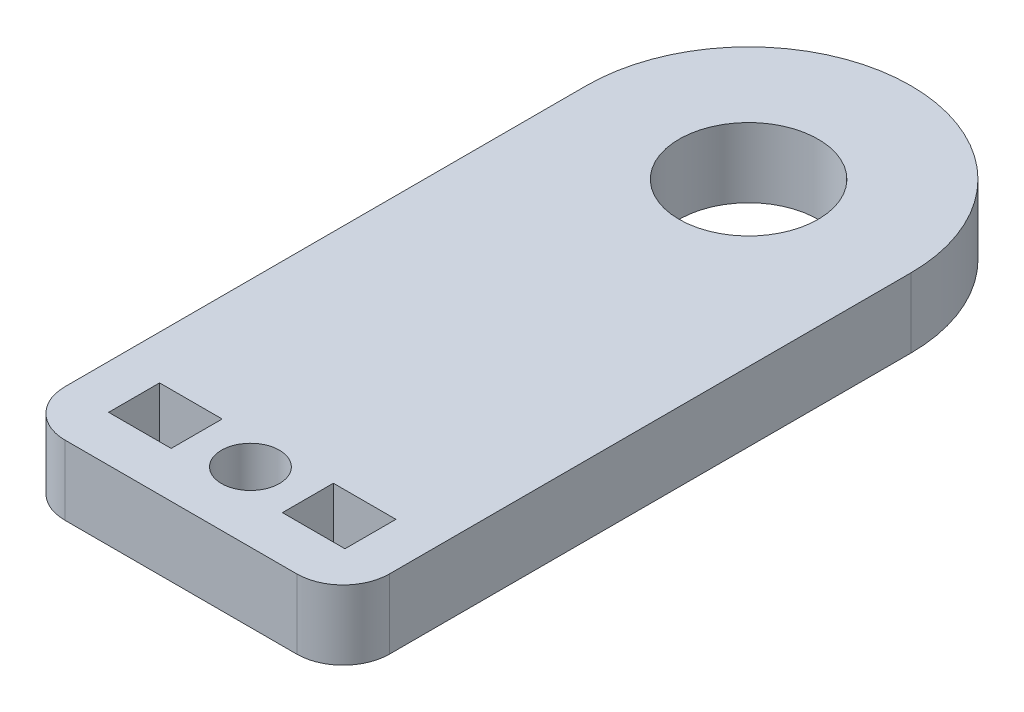
ISO-10303-21;
HEADER;
FILE_DESCRIPTION(('STEP AP214'),'2;1');
FILE_NAME('part.step','',(''),(''),'','','');
FILE_SCHEMA(('AUTOMOTIVE_DESIGN { 1 0 10303 214 1 1 1 1 }'));
ENDSEC;
DATA;
#1=APPLICATION_CONTEXT('core data for automotive mechanical design processes');
#2=APPLICATION_PROTOCOL_DEFINITION('international standard','automotive_design',2000,#1);
#3=PRODUCT_CONTEXT('',#1,'mechanical');
#4=PRODUCT('Part','Part','',(#3));
#5=PRODUCT_RELATED_PRODUCT_CATEGORY('part','',(#4));
#6=PRODUCT_DEFINITION_FORMATION('','',#4);
#7=PRODUCT_DEFINITION_CONTEXT('part definition',#1,'design');
#8=PRODUCT_DEFINITION('design','',#6,#7);
#9=PRODUCT_DEFINITION_SHAPE('','',#8);
#10=(LENGTH_UNIT() NAMED_UNIT(*) SI_UNIT(.MILLI.,.METRE.));
#11=(NAMED_UNIT(*) PLANE_ANGLE_UNIT() SI_UNIT($,.RADIAN.));
#12=(NAMED_UNIT(*) SI_UNIT($,.STERADIAN.) SOLID_ANGLE_UNIT());
#13=UNCERTAINTY_MEASURE_WITH_UNIT(LENGTH_MEASURE(1.E-05),#10,'distance_accuracy_value','');
#14=(GEOMETRIC_REPRESENTATION_CONTEXT(3) GLOBAL_UNCERTAINTY_ASSIGNED_CONTEXT((#13)) GLOBAL_UNIT_ASSIGNED_CONTEXT((#10,
#11,#12)) REPRESENTATION_CONTEXT('',''));
#15=CARTESIAN_POINT('',(0.,0.,0.));
#16=DIRECTION('',(0.,0.,1.));
#17=DIRECTION('',(1.,0.,0.));
#18=AXIS2_PLACEMENT_3D('',#15,#16,#17);
#19=CARTESIAN_POINT('',(0.,3.,-12.25));
#20=DIRECTION('',(0.,-1.,0.));
#21=DIRECTION('',(0.,0.,-1.));
#22=AXIS2_PLACEMENT_3D('',#19,#20,#21);
#23=CYLINDRICAL_SURFACE('',#22,7.);
#24=DIRECTION('',(0.,-1.,0.));
#25=VECTOR('',#24,1.);
#26=CARTESIAN_POINT('',(-7.,3.,-12.25));
#27=LINE('',#26,#25);
#28=CARTESIAN_POINT('',(-7.,3.,-12.25));
#29=VERTEX_POINT('',#28);
#30=CARTESIAN_POINT('',(-7.,0.,-12.25));
#31=VERTEX_POINT('',#30);
#32=EDGE_CURVE('E225',#29,#31,#27,.T.);
#33=ORIENTED_EDGE('',*,*,#32,.F.);
#34=CARTESIAN_POINT('',(0.,3.,-12.25));
#35=DIRECTION('',(0.,1.,0.));
#36=DIRECTION('',(0.,0.,1.));
#37=AXIS2_PLACEMENT_3D('',#34,#35,#36);
#38=CIRCLE('',#37,7.);
#39=CARTESIAN_POINT('',(7.,3.,-12.25));
#40=VERTEX_POINT('',#39);
#41=EDGE_CURVE('E233',#40,#29,#38,.T.);
#42=ORIENTED_EDGE('',*,*,#41,.F.);
#43=DIRECTION('',(0.,-1.,0.));
#44=VECTOR('',#43,1.);
#45=CARTESIAN_POINT('',(7.,3.,-12.25));
#46=LINE('',#45,#44);
#47=CARTESIAN_POINT('',(7.,0.,-12.25));
#48=VERTEX_POINT('',#47);
#49=EDGE_CURVE('E181',#40,#48,#46,.T.);
#50=ORIENTED_EDGE('',*,*,#49,.T.);
#51=CARTESIAN_POINT('',(0.,0.,-12.25));
#52=DIRECTION('',(0.,1.,0.));
#53=DIRECTION('',(0.,0.,1.));
#54=AXIS2_PLACEMENT_3D('',#51,#52,#53);
#55=CIRCLE('',#54,7.);
#56=EDGE_CURVE('E221',#48,#31,#55,.T.);
#57=ORIENTED_EDGE('',*,*,#56,.T.);
#58=EDGE_LOOP('',(#33,#42,#50,#57));
#59=FACE_BOUND('',#58,.T.);
#60=ADVANCED_FACE('F37',(#59),#23,.T.);
#61=CARTESIAN_POINT('',(0.,3.,-12.25));
#62=DIRECTION('',(0.,-1.,0.));
#63=DIRECTION('',(0.,0.,-1.));
#64=AXIS2_PLACEMENT_3D('',#61,#62,#63);
#65=CYLINDRICAL_SURFACE('',#64,3.);
#66=CARTESIAN_POINT('',(0.,3.,-12.25));
#67=DIRECTION('',(0.,1.,0.));
#68=DIRECTION('',(0.,0.,1.));
#69=AXIS2_PLACEMENT_3D('',#66,#67,#68);
#70=CIRCLE('',#69,3.);
#71=CARTESIAN_POINT('',(0.,3.,-9.25));
#72=VERTEX_POINT('',#71);
#73=EDGE_CURVE('E236',#72,#72,#70,.T.);
#74=ORIENTED_EDGE('',*,*,#73,.T.);
#75=EDGE_LOOP('',(#74));
#76=FACE_BOUND('',#75,.T.);
#77=CARTESIAN_POINT('',(0.,0.,-12.25));
#78=DIRECTION('',(0.,1.,0.));
#79=DIRECTION('',(0.,0.,1.));
#80=AXIS2_PLACEMENT_3D('',#77,#78,#79);
#81=CIRCLE('',#80,3.);
#82=CARTESIAN_POINT('',(0.,0.,-9.25));
#83=VERTEX_POINT('',#82);
#84=EDGE_CURVE('E237',#83,#83,#81,.T.);
#85=ORIENTED_EDGE('',*,*,#84,.F.);
#86=EDGE_LOOP('',(#85));
#87=FACE_BOUND('',#86,.T.);
#88=ADVANCED_FACE('F292',(#76,#87),#65,.F.);
#89=CARTESIAN_POINT('',(0.,3.,0.));
#90=DIRECTION('',(0.,1.,0.));
#91=DIRECTION('',(0.,0.,1.));
#92=AXIS2_PLACEMENT_3D('',#89,#90,#91);
#93=PLANE('',#92);
#94=DIRECTION('',(1.,0.,0.));
#95=VECTOR('',#94,1.);
#96=CARTESIAN_POINT('',(0.,3.,12.25));
#97=LINE('',#96,#95);
#98=CARTESIAN_POINT('',(-4.99999999999999,3.,12.25));
#99=VERTEX_POINT('',#98);
#100=CARTESIAN_POINT('',(5.,3.,12.25));
#101=VERTEX_POINT('',#100);
#102=EDGE_CURVE('E261',#99,#101,#97,.T.);
#103=ORIENTED_EDGE('',*,*,#102,.T.);
#104=CARTESIAN_POINT('',(5.,3.,10.25));
#105=DIRECTION('',(0.,1.,0.));
#106=DIRECTION('',(0.,0.,1.));
#107=AXIS2_PLACEMENT_3D('',#104,#105,#106);
#108=CIRCLE('',#107,2.);
#109=CARTESIAN_POINT('',(7.,3.,10.25));
#110=VERTEX_POINT('',#109);
#111=EDGE_CURVE('E45',#101,#110,#108,.T.);
#112=ORIENTED_EDGE('',*,*,#111,.T.);
#113=DIRECTION('',(0.,0.,-1.));
#114=VECTOR('',#113,1.);
#115=CARTESIAN_POINT('',(7.,3.,0.));
#116=LINE('',#115,#114);
#117=EDGE_CURVE('E160',#110,#40,#116,.T.);
#118=ORIENTED_EDGE('',*,*,#117,.T.);
#119=ORIENTED_EDGE('',*,*,#41,.T.);
#120=DIRECTION('',(0.,0.,-1.));
#121=VECTOR('',#120,1.);
#122=CARTESIAN_POINT('',(-7.,3.,0.));
#123=LINE('',#122,#121);
#124=CARTESIAN_POINT('',(-6.99999999999999,3.,10.25));
#125=VERTEX_POINT('',#124);
#126=EDGE_CURVE('E280',#125,#29,#123,.T.);
#127=ORIENTED_EDGE('',*,*,#126,.F.);
#128=CARTESIAN_POINT('',(-4.99999999999999,3.,10.25));
#129=DIRECTION('',(0.,1.,0.));
#130=DIRECTION('',(0.,0.,1.));
#131=AXIS2_PLACEMENT_3D('',#128,#129,#130);
#132=CIRCLE('',#131,2.);
#133=EDGE_CURVE('E255',#125,#99,#132,.T.);
#134=ORIENTED_EDGE('',*,*,#133,.T.);
#135=EDGE_LOOP('',(#103,#112,#118,#119,#127,#134));
#136=FACE_BOUND('',#135,.T.);
#137=ORIENTED_EDGE('',*,*,#73,.F.);
#138=EDGE_LOOP('',(#137));
#139=FACE_BOUND('',#138,.T.);
#140=CARTESIAN_POINT('',(0.,3.,9.25));
#141=DIRECTION('',(0.,1.,0.));
#142=DIRECTION('',(0.,0.,1.));
#143=AXIS2_PLACEMENT_3D('',#140,#141,#142);
#144=CIRCLE('',#143,1.25);
#145=CARTESIAN_POINT('',(0.,3.,10.5));
#146=VERTEX_POINT('',#145);
#147=EDGE_CURVE('E212',#146,#146,#144,.T.);
#148=ORIENTED_EDGE('',*,*,#147,.F.);
#149=EDGE_LOOP('',(#148));
#150=FACE_BOUND('',#149,.T.);
#151=DIRECTION('',(0.,0.,1.));
#152=VECTOR('',#151,1.);
#153=CARTESIAN_POINT('',(-5.1,3.,0.));
#154=LINE('',#153,#152);
#155=CARTESIAN_POINT('',(-5.1,3.,8.07071615635404));
#156=VERTEX_POINT('',#155);
#157=CARTESIAN_POINT('',(-5.1,3.,10.270716156354));
#158=VERTEX_POINT('',#157);
#159=EDGE_CURVE('E142',#156,#158,#154,.T.);
#160=ORIENTED_EDGE('',*,*,#159,.F.);
#161=DIRECTION('',(-1.,0.,0.));
#162=VECTOR('',#161,1.);
#163=CARTESIAN_POINT('',(0.,3.,8.07071615635404));
#164=LINE('',#163,#162);
#165=CARTESIAN_POINT('',(-2.4,3.,8.07071615635404));
#166=VERTEX_POINT('',#165);
#167=EDGE_CURVE('E157',#166,#156,#164,.T.);
#168=ORIENTED_EDGE('',*,*,#167,.F.);
#169=DIRECTION('',(0.,0.,1.));
#170=VECTOR('',#169,1.);
#171=CARTESIAN_POINT('',(-2.4,3.,0.));
#172=LINE('',#171,#170);
#173=CARTESIAN_POINT('',(-2.4,3.,10.270716156354));
#174=VERTEX_POINT('',#173);
#175=EDGE_CURVE('E164',#166,#174,#172,.T.);
#176=ORIENTED_EDGE('',*,*,#175,.T.);
#177=DIRECTION('',(-1.,0.,0.));
#178=VECTOR('',#177,1.);
#179=CARTESIAN_POINT('',(0.,3.,10.270716156354));
#180=LINE('',#179,#178);
#181=EDGE_CURVE('E158',#174,#158,#180,.T.);
#182=ORIENTED_EDGE('',*,*,#181,.T.);
#183=EDGE_LOOP('',(#160,#168,#176,#182));
#184=FACE_BOUND('',#183,.T.);
#185=DIRECTION('',(0.,0.,1.));
#186=VECTOR('',#185,1.);
#187=CARTESIAN_POINT('',(2.40000000000001,3.,0.));
#188=LINE('',#187,#186);
#189=CARTESIAN_POINT('',(2.40000000000001,3.,8.07071615635404));
#190=VERTEX_POINT('',#189);
#191=CARTESIAN_POINT('',(2.40000000000001,3.,10.270716156354));
#192=VERTEX_POINT('',#191);
#193=EDGE_CURVE('E170',#190,#192,#188,.T.);
#194=ORIENTED_EDGE('',*,*,#193,.F.);
#195=DIRECTION('',(1.,0.,0.));
#196=VECTOR('',#195,1.);
#197=CARTESIAN_POINT('',(0.,3.,8.07071615635404));
#198=LINE('',#197,#196);
#199=CARTESIAN_POINT('',(5.10000000000001,3.,8.07071615635404));
#200=VERTEX_POINT('',#199);
#201=EDGE_CURVE('E173',#190,#200,#198,.T.);
#202=ORIENTED_EDGE('',*,*,#201,.T.);
#203=DIRECTION('',(0.,0.,1.));
#204=VECTOR('',#203,1.);
#205=CARTESIAN_POINT('',(5.10000000000001,3.,0.));
#206=LINE('',#205,#204);
#207=CARTESIAN_POINT('',(5.10000000000001,3.,10.270716156354));
#208=VERTEX_POINT('',#207);
#209=EDGE_CURVE('E176',#200,#208,#206,.T.);
#210=ORIENTED_EDGE('',*,*,#209,.T.);
#211=DIRECTION('',(1.,0.,0.));
#212=VECTOR('',#211,1.);
#213=CARTESIAN_POINT('',(0.,3.,10.270716156354));
#214=LINE('',#213,#212);
#215=EDGE_CURVE('E178',#192,#208,#214,.T.);
#216=ORIENTED_EDGE('',*,*,#215,.F.);
#217=EDGE_LOOP('',(#194,#202,#210,#216));
#218=FACE_BOUND('',#217,.T.);
#219=ADVANCED_FACE('F154',(#136,#139,#150,#184,#218),#93,.T.);
#220=CARTESIAN_POINT('',(0.,0.,0.));
#221=DIRECTION('',(0.,1.,0.));
#222=DIRECTION('',(0.,0.,1.));
#223=AXIS2_PLACEMENT_3D('',#220,#221,#222);
#224=PLANE('',#223);
#225=DIRECTION('',(0.,0.,-1.));
#226=VECTOR('',#225,1.);
#227=CARTESIAN_POINT('',(7.,0.,0.));
#228=LINE('',#227,#226);
#229=CARTESIAN_POINT('',(7.,0.,10.25));
#230=VERTEX_POINT('',#229);
#231=EDGE_CURVE('E189',#230,#48,#228,.T.);
#232=ORIENTED_EDGE('',*,*,#231,.F.);
#233=CARTESIAN_POINT('',(5.,0.,10.25));
#234=DIRECTION('',(0.,1.,0.));
#235=DIRECTION('',(0.,0.,1.));
#236=AXIS2_PLACEMENT_3D('',#233,#234,#235);
#237=CIRCLE('',#236,2.);
#238=CARTESIAN_POINT('',(5.,0.,12.25));
#239=VERTEX_POINT('',#238);
#240=EDGE_CURVE('E249',#230,#239,#237,.F.);
#241=ORIENTED_EDGE('',*,*,#240,.T.);
#242=DIRECTION('',(1.,0.,0.));
#243=VECTOR('',#242,1.);
#244=CARTESIAN_POINT('',(0.,0.,12.25));
#245=LINE('',#244,#243);
#246=CARTESIAN_POINT('',(-4.99999999999999,0.,12.25));
#247=VERTEX_POINT('',#246);
#248=EDGE_CURVE('E187',#247,#239,#245,.T.);
#249=ORIENTED_EDGE('',*,*,#248,.F.);
#250=CARTESIAN_POINT('',(-4.99999999999999,0.,10.25));
#251=DIRECTION('',(0.,1.,0.));
#252=DIRECTION('',(0.,0.,1.));
#253=AXIS2_PLACEMENT_3D('',#250,#251,#252);
#254=CIRCLE('',#253,2.);
#255=CARTESIAN_POINT('',(-6.99999999999999,0.,10.25));
#256=VERTEX_POINT('',#255);
#257=EDGE_CURVE('E247',#247,#256,#254,.F.);
#258=ORIENTED_EDGE('',*,*,#257,.T.);
#259=DIRECTION('',(0.,0.,-1.));
#260=VECTOR('',#259,1.);
#261=CARTESIAN_POINT('',(-7.,0.,0.));
#262=LINE('',#261,#260);
#263=EDGE_CURVE('E185',#256,#31,#262,.T.);
#264=ORIENTED_EDGE('',*,*,#263,.T.);
#265=ORIENTED_EDGE('',*,*,#56,.F.);
#266=EDGE_LOOP('',(#232,#241,#249,#258,#264,#265));
#267=FACE_BOUND('',#266,.T.);
#268=ORIENTED_EDGE('',*,*,#84,.T.);
#269=EDGE_LOOP('',(#268));
#270=FACE_BOUND('',#269,.T.);
#271=CARTESIAN_POINT('',(0.,0.,9.25));
#272=DIRECTION('',(0.,1.,0.));
#273=DIRECTION('',(0.,0.,1.));
#274=AXIS2_PLACEMENT_3D('',#271,#272,#273);
#275=CIRCLE('',#274,1.25);
#276=CARTESIAN_POINT('',(0.,0.,10.5));
#277=VERTEX_POINT('',#276);
#278=EDGE_CURVE('E182',#277,#277,#275,.T.);
#279=ORIENTED_EDGE('',*,*,#278,.T.);
#280=EDGE_LOOP('',(#279));
#281=FACE_BOUND('',#280,.T.);
#282=DIRECTION('',(0.,0.,1.));
#283=VECTOR('',#282,1.);
#284=CARTESIAN_POINT('',(-5.1,0.,0.));
#285=LINE('',#284,#283);
#286=CARTESIAN_POINT('',(-5.1,0.,8.07071615635404));
#287=VERTEX_POINT('',#286);
#288=CARTESIAN_POINT('',(-5.1,0.,10.270716156354));
#289=VERTEX_POINT('',#288);
#290=EDGE_CURVE('E144',#287,#289,#285,.T.);
#291=ORIENTED_EDGE('',*,*,#290,.T.);
#292=DIRECTION('',(-1.,0.,0.));
#293=VECTOR('',#292,1.);
#294=CARTESIAN_POINT('',(0.,0.,10.270716156354));
#295=LINE('',#294,#293);
#296=CARTESIAN_POINT('',(-2.4,0.,10.270716156354));
#297=VERTEX_POINT('',#296);
#298=EDGE_CURVE('E197',#297,#289,#295,.T.);
#299=ORIENTED_EDGE('',*,*,#298,.F.);
#300=DIRECTION('',(0.,0.,1.));
#301=VECTOR('',#300,1.);
#302=CARTESIAN_POINT('',(-2.4,0.,0.));
#303=LINE('',#302,#301);
#304=CARTESIAN_POINT('',(-2.4,0.,8.07071615635404));
#305=VERTEX_POINT('',#304);
#306=EDGE_CURVE('E194',#305,#297,#303,.T.);
#307=ORIENTED_EDGE('',*,*,#306,.F.);
#308=DIRECTION('',(-1.,0.,0.));
#309=VECTOR('',#308,1.);
#310=CARTESIAN_POINT('',(0.,0.,8.07071615635404));
#311=LINE('',#310,#309);
#312=EDGE_CURVE('E192',#305,#287,#311,.T.);
#313=ORIENTED_EDGE('',*,*,#312,.T.);
#314=EDGE_LOOP('',(#291,#299,#307,#313));
#315=FACE_BOUND('',#314,.T.);
#316=DIRECTION('',(0.,0.,1.));
#317=VECTOR('',#316,1.);
#318=CARTESIAN_POINT('',(2.40000000000001,0.,0.));
#319=LINE('',#318,#317);
#320=CARTESIAN_POINT('',(2.40000000000001,0.,8.07071615635404));
#321=VERTEX_POINT('',#320);
#322=CARTESIAN_POINT('',(2.40000000000001,0.,10.270716156354));
#323=VERTEX_POINT('',#322);
#324=EDGE_CURVE('E200',#321,#323,#319,.T.);
#325=ORIENTED_EDGE('',*,*,#324,.T.);
#326=DIRECTION('',(1.,0.,0.));
#327=VECTOR('',#326,1.);
#328=CARTESIAN_POINT('',(0.,0.,10.270716156354));
#329=LINE('',#328,#327);
#330=CARTESIAN_POINT('',(5.10000000000001,0.,10.270716156354));
#331=VERTEX_POINT('',#330);
#332=EDGE_CURVE('E209',#323,#331,#329,.T.);
#333=ORIENTED_EDGE('',*,*,#332,.T.);
#334=DIRECTION('',(0.,0.,1.));
#335=VECTOR('',#334,1.);
#336=CARTESIAN_POINT('',(5.10000000000001,0.,0.));
#337=LINE('',#336,#335);
#338=CARTESIAN_POINT('',(5.10000000000001,0.,8.07071615635404));
#339=VERTEX_POINT('',#338);
#340=EDGE_CURVE('E206',#339,#331,#337,.T.);
#341=ORIENTED_EDGE('',*,*,#340,.F.);
#342=DIRECTION('',(1.,0.,0.));
#343=VECTOR('',#342,1.);
#344=CARTESIAN_POINT('',(0.,0.,8.07071615635404));
#345=LINE('',#344,#343);
#346=EDGE_CURVE('E203',#321,#339,#345,.T.);
#347=ORIENTED_EDGE('',*,*,#346,.F.);
#348=EDGE_LOOP('',(#325,#333,#341,#347));
#349=FACE_BOUND('',#348,.T.);
#350=ADVANCED_FACE('F271',(#267,#270,#281,#315,#349),#224,.F.);
#351=CARTESIAN_POINT('',(2.40000000000001,3.,0.));
#352=DIRECTION('',(1.,0.,0.));
#353=DIRECTION('',(0.,0.,-1.));
#354=AXIS2_PLACEMENT_3D('',#351,#352,#353);
#355=PLANE('',#354);
#356=ORIENTED_EDGE('',*,*,#324,.F.);
#357=DIRECTION('',(0.,-1.,0.));
#358=VECTOR('',#357,1.);
#359=CARTESIAN_POINT('',(2.40000000000001,3.,8.07071615635404));
#360=LINE('',#359,#358);
#361=EDGE_CURVE('E219',#190,#321,#360,.T.);
#362=ORIENTED_EDGE('',*,*,#361,.F.);
#363=ORIENTED_EDGE('',*,*,#193,.T.);
#364=DIRECTION('',(0.,-1.,0.));
#365=VECTOR('',#364,1.);
#366=CARTESIAN_POINT('',(2.40000000000001,3.,10.270716156354));
#367=LINE('',#366,#365);
#368=EDGE_CURVE('E149',#192,#323,#367,.T.);
#369=ORIENTED_EDGE('',*,*,#368,.T.);
#370=EDGE_LOOP('',(#356,#362,#363,#369));
#371=FACE_BOUND('',#370,.T.);
#372=ADVANCED_FACE('F298',(#371),#355,.T.);
#373=CARTESIAN_POINT('',(0.,3.,8.07071615635404));
#374=DIRECTION('',(0.,0.,-1.));
#375=DIRECTION('',(-1.,0.,0.));
#376=AXIS2_PLACEMENT_3D('',#373,#374,#375);
#377=PLANE('',#376);
#378=ORIENTED_EDGE('',*,*,#346,.T.);
#379=DIRECTION('',(0.,-1.,0.));
#380=VECTOR('',#379,1.);
#381=CARTESIAN_POINT('',(5.10000000000001,3.,8.07071615635404));
#382=LINE('',#381,#380);
#383=EDGE_CURVE('E216',#200,#339,#382,.T.);
#384=ORIENTED_EDGE('',*,*,#383,.F.);
#385=ORIENTED_EDGE('',*,*,#201,.F.);
#386=ORIENTED_EDGE('',*,*,#361,.T.);
#387=EDGE_LOOP('',(#378,#384,#385,#386));
#388=FACE_BOUND('',#387,.T.);
#389=ADVANCED_FACE('F323',(#388),#377,.F.);
#390=CARTESIAN_POINT('',(5.10000000000001,3.,0.));
#391=DIRECTION('',(1.,0.,0.));
#392=DIRECTION('',(0.,0.,-1.));
#393=AXIS2_PLACEMENT_3D('',#390,#391,#392);
#394=PLANE('',#393);
#395=ORIENTED_EDGE('',*,*,#340,.T.);
#396=DIRECTION('',(0.,-1.,0.));
#397=VECTOR('',#396,1.);
#398=CARTESIAN_POINT('',(5.10000000000001,3.,10.270716156354));
#399=LINE('',#398,#397);
#400=EDGE_CURVE('E214',#208,#331,#399,.T.);
#401=ORIENTED_EDGE('',*,*,#400,.F.);
#402=ORIENTED_EDGE('',*,*,#209,.F.);
#403=ORIENTED_EDGE('',*,*,#383,.T.);
#404=EDGE_LOOP('',(#395,#401,#402,#403));
#405=FACE_BOUND('',#404,.T.);
#406=ADVANCED_FACE('F320',(#405),#394,.F.);
#407=CARTESIAN_POINT('',(-5.1,3.,0.));
#408=DIRECTION('',(1.,0.,0.));
#409=DIRECTION('',(0.,0.,-1.));
#410=AXIS2_PLACEMENT_3D('',#407,#408,#409);
#411=PLANE('',#410);
#412=ORIENTED_EDGE('',*,*,#290,.F.);
#413=DIRECTION('',(0.,-1.,0.));
#414=VECTOR('',#413,1.);
#415=CARTESIAN_POINT('',(-5.1,3.,8.07071615635404));
#416=LINE('',#415,#414);
#417=EDGE_CURVE('E139',#156,#287,#416,.T.);
#418=ORIENTED_EDGE('',*,*,#417,.F.);
#419=ORIENTED_EDGE('',*,*,#159,.T.);
#420=DIRECTION('',(0.,-1.,0.));
#421=VECTOR('',#420,1.);
#422=CARTESIAN_POINT('',(-5.1,3.,10.270716156354));
#423=LINE('',#422,#421);
#424=EDGE_CURVE('E222',#158,#289,#423,.T.);
#425=ORIENTED_EDGE('',*,*,#424,.T.);
#426=EDGE_LOOP('',(#412,#418,#419,#425));
#427=FACE_BOUND('',#426,.T.);
#428=ADVANCED_FACE('F141',(#427),#411,.T.);
#429=CARTESIAN_POINT('',(0.,3.,8.07071615635404));
#430=DIRECTION('',(0.,0.,1.));
#431=DIRECTION('',(1.,0.,0.));
#432=AXIS2_PLACEMENT_3D('',#429,#430,#431);
#433=PLANE('',#432);
#434=ORIENTED_EDGE('',*,*,#312,.F.);
#435=DIRECTION('',(0.,-1.,0.));
#436=VECTOR('',#435,1.);
#437=CARTESIAN_POINT('',(-2.4,3.,8.07071615635404));
#438=LINE('',#437,#436);
#439=EDGE_CURVE('E150',#166,#305,#438,.T.);
#440=ORIENTED_EDGE('',*,*,#439,.F.);
#441=ORIENTED_EDGE('',*,*,#167,.T.);
#442=ORIENTED_EDGE('',*,*,#417,.T.);
#443=EDGE_LOOP('',(#434,#440,#441,#442));
#444=FACE_BOUND('',#443,.T.);
#445=ADVANCED_FACE('F162',(#444),#433,.T.);
#446=CARTESIAN_POINT('',(-2.4,3.,0.));
#447=DIRECTION('',(1.,0.,0.));
#448=DIRECTION('',(0.,0.,-1.));
#449=AXIS2_PLACEMENT_3D('',#446,#447,#448);
#450=PLANE('',#449);
#451=ORIENTED_EDGE('',*,*,#306,.T.);
#452=DIRECTION('',(0.,-1.,0.));
#453=VECTOR('',#452,1.);
#454=CARTESIAN_POINT('',(-2.4,3.,10.270716156354));
#455=LINE('',#454,#453);
#456=EDGE_CURVE('E224',#174,#297,#455,.T.);
#457=ORIENTED_EDGE('',*,*,#456,.F.);
#458=ORIENTED_EDGE('',*,*,#175,.F.);
#459=ORIENTED_EDGE('',*,*,#439,.T.);
#460=EDGE_LOOP('',(#451,#457,#458,#459));
#461=FACE_BOUND('',#460,.T.);
#462=ADVANCED_FACE('F335',(#461),#450,.F.);
#463=CARTESIAN_POINT('',(-7.,3.,0.));
#464=DIRECTION('',(-1.,0.,0.));
#465=DIRECTION('',(0.,0.,1.));
#466=AXIS2_PLACEMENT_3D('',#463,#464,#465);
#467=PLANE('',#466);
#468=ORIENTED_EDGE('',*,*,#263,.F.);
#469=DIRECTION('',(0.,-1.,0.));
#470=VECTOR('',#469,1.);
#471=CARTESIAN_POINT('',(-6.99999999999999,3.,10.25));
#472=LINE('',#471,#470);
#473=EDGE_CURVE('E11',#256,#125,#472,.F.);
#474=ORIENTED_EDGE('',*,*,#473,.T.);
#475=ORIENTED_EDGE('',*,*,#126,.T.);
#476=ORIENTED_EDGE('',*,*,#32,.T.);
#477=EDGE_LOOP('',(#468,#474,#475,#476));
#478=FACE_BOUND('',#477,.T.);
#479=ADVANCED_FACE('F278',(#478),#467,.T.);
#480=CARTESIAN_POINT('',(0.,3.,12.25));
#481=DIRECTION('',(0.,0.,-1.));
#482=DIRECTION('',(-1.,0.,0.));
#483=AXIS2_PLACEMENT_3D('',#480,#481,#482);
#484=PLANE('',#483);
#485=ORIENTED_EDGE('',*,*,#248,.T.);
#486=DIRECTION('',(0.,-1.,0.));
#487=VECTOR('',#486,1.);
#488=CARTESIAN_POINT('',(5.,3.,12.25));
#489=LINE('',#488,#487);
#490=EDGE_CURVE('E58',#239,#101,#489,.F.);
#491=ORIENTED_EDGE('',*,*,#490,.T.);
#492=ORIENTED_EDGE('',*,*,#102,.F.);
#493=DIRECTION('',(0.,-1.,0.));
#494=VECTOR('',#493,1.);
#495=CARTESIAN_POINT('',(-4.99999999999999,0.,12.25));
#496=LINE('',#495,#494);
#497=EDGE_CURVE('E251',#99,#247,#496,.T.);
#498=ORIENTED_EDGE('',*,*,#497,.T.);
#499=EDGE_LOOP('',(#485,#491,#492,#498));
#500=FACE_BOUND('',#499,.T.);
#501=ADVANCED_FACE('F274',(#500),#484,.F.);
#502=CARTESIAN_POINT('',(0.,3.,10.270716156354));
#503=DIRECTION('',(0.,0.,1.));
#504=DIRECTION('',(1.,0.,0.));
#505=AXIS2_PLACEMENT_3D('',#502,#503,#504);
#506=PLANE('',#505);
#507=ORIENTED_EDGE('',*,*,#298,.T.);
#508=ORIENTED_EDGE('',*,*,#424,.F.);
#509=ORIENTED_EDGE('',*,*,#181,.F.);
#510=ORIENTED_EDGE('',*,*,#456,.T.);
#511=EDGE_LOOP('',(#507,#508,#509,#510));
#512=FACE_BOUND('',#511,.T.);
#513=ADVANCED_FACE('F331',(#512),#506,.F.);
#514=CARTESIAN_POINT('',(7.,3.,0.));
#515=DIRECTION('',(-1.,0.,0.));
#516=DIRECTION('',(0.,0.,1.));
#517=AXIS2_PLACEMENT_3D('',#514,#515,#516);
#518=PLANE('',#517);
#519=ORIENTED_EDGE('',*,*,#117,.F.);
#520=DIRECTION('',(0.,-1.,0.));
#521=VECTOR('',#520,1.);
#522=CARTESIAN_POINT('',(7.,3.,10.25));
#523=LINE('',#522,#521);
#524=EDGE_CURVE('E240',#110,#230,#523,.T.);
#525=ORIENTED_EDGE('',*,*,#524,.T.);
#526=ORIENTED_EDGE('',*,*,#231,.T.);
#527=ORIENTED_EDGE('',*,*,#49,.F.);
#528=EDGE_LOOP('',(#519,#525,#526,#527));
#529=FACE_BOUND('',#528,.T.);
#530=ADVANCED_FACE('F266',(#529),#518,.F.);
#531=CARTESIAN_POINT('',(0.,3.,9.25));
#532=DIRECTION('',(0.,-1.,0.));
#533=DIRECTION('',(0.,0.,-1.));
#534=AXIS2_PLACEMENT_3D('',#531,#532,#533);
#535=CYLINDRICAL_SURFACE('',#534,1.25);
#536=ORIENTED_EDGE('',*,*,#147,.T.);
#537=EDGE_LOOP('',(#536));
#538=FACE_BOUND('',#537,.T.);
#539=ORIENTED_EDGE('',*,*,#278,.F.);
#540=EDGE_LOOP('',(#539));
#541=FACE_BOUND('',#540,.T.);
#542=ADVANCED_FACE('F288',(#538,#541),#535,.F.);
#543=CARTESIAN_POINT('',(0.,3.,10.270716156354));
#544=DIRECTION('',(0.,0.,-1.));
#545=DIRECTION('',(-1.,0.,0.));
#546=AXIS2_PLACEMENT_3D('',#543,#544,#545);
#547=PLANE('',#546);
#548=ORIENTED_EDGE('',*,*,#332,.F.);
#549=ORIENTED_EDGE('',*,*,#368,.F.);
#550=ORIENTED_EDGE('',*,*,#215,.T.);
#551=ORIENTED_EDGE('',*,*,#400,.T.);
#552=EDGE_LOOP('',(#548,#549,#550,#551));
#553=FACE_BOUND('',#552,.T.);
#554=ADVANCED_FACE('F308',(#553),#547,.T.);
#555=CARTESIAN_POINT('',(5.,3.,10.25));
#556=DIRECTION('',(0.,-1.,0.));
#557=DIRECTION('',(0.,0.,-1.));
#558=AXIS2_PLACEMENT_3D('',#555,#556,#557);
#559=CYLINDRICAL_SURFACE('',#558,2.);
#560=ORIENTED_EDGE('',*,*,#111,.F.);
#561=ORIENTED_EDGE('',*,*,#490,.F.);
#562=ORIENTED_EDGE('',*,*,#240,.F.);
#563=ORIENTED_EDGE('',*,*,#524,.F.);
#564=EDGE_LOOP('',(#560,#561,#562,#563));
#565=FACE_BOUND('',#564,.T.);
#566=ADVANCED_FACE('F268',(#565),#559,.T.);
#567=CARTESIAN_POINT('',(-4.99999999999999,3.,10.25));
#568=DIRECTION('',(0.,1.,0.));
#569=DIRECTION('',(0.,0.,1.));
#570=AXIS2_PLACEMENT_3D('',#567,#568,#569);
#571=CYLINDRICAL_SURFACE('',#570,2.);
#572=ORIENTED_EDGE('',*,*,#133,.F.);
#573=ORIENTED_EDGE('',*,*,#473,.F.);
#574=ORIENTED_EDGE('',*,*,#257,.F.);
#575=ORIENTED_EDGE('',*,*,#497,.F.);
#576=EDGE_LOOP('',(#572,#573,#574,#575));
#577=FACE_BOUND('',#576,.T.);
#578=ADVANCED_FACE('F39',(#577),#571,.T.);
#579=CLOSED_SHELL('',(#60,#88,#219,#350,#372,#389,#406,#428,#445,#462,#479,#501,#513,#530,#542,
#554,#566,#578));
#580=MANIFOLD_SOLID_BREP('B2',#579);
#581=ADVANCED_BREP_SHAPE_REPRESENTATION('',(#18,#580),#14);
#582=SHAPE_DEFINITION_REPRESENTATION(#9,#581);
ENDSEC;
END-ISO-10303-21;
